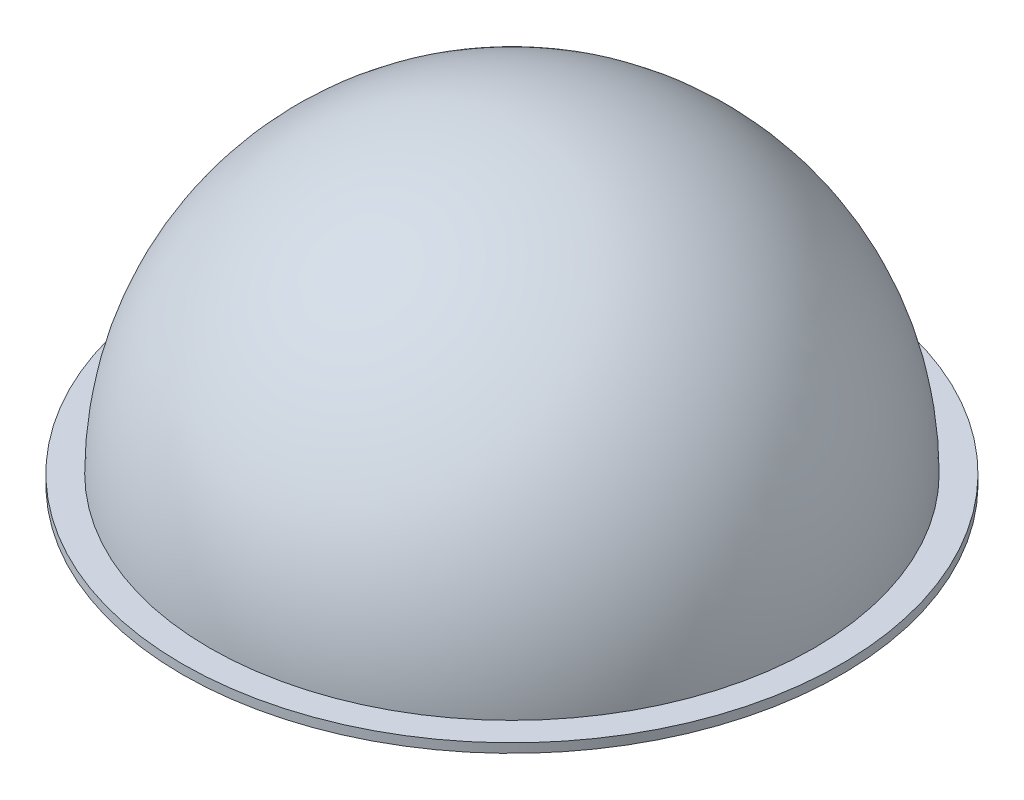
ISO-10303-21;
HEADER;
FILE_DESCRIPTION(('STEP AP214'),'2;1');
FILE_NAME('part.step','',(''),(''),'','','');
FILE_SCHEMA(('AUTOMOTIVE_DESIGN { 1 0 10303 214 1 1 1 1 }'));
ENDSEC;
DATA;
#1=APPLICATION_CONTEXT('core data for automotive mechanical design processes');
#2=APPLICATION_PROTOCOL_DEFINITION('international standard','automotive_design',2000,#1);
#3=PRODUCT_CONTEXT('',#1,'mechanical');
#4=PRODUCT('Part','Part','',(#3));
#5=PRODUCT_RELATED_PRODUCT_CATEGORY('part','',(#4));
#6=PRODUCT_DEFINITION_FORMATION('','',#4);
#7=PRODUCT_DEFINITION_CONTEXT('part definition',#1,'design');
#8=PRODUCT_DEFINITION('design','',#6,#7);
#9=PRODUCT_DEFINITION_SHAPE('','',#8);
#10=(LENGTH_UNIT() NAMED_UNIT(*) SI_UNIT(.MILLI.,.METRE.));
#11=(NAMED_UNIT(*) PLANE_ANGLE_UNIT() SI_UNIT($,.RADIAN.));
#12=(NAMED_UNIT(*) SI_UNIT($,.STERADIAN.) SOLID_ANGLE_UNIT());
#13=UNCERTAINTY_MEASURE_WITH_UNIT(LENGTH_MEASURE(1.E-05),#10,'distance_accuracy_value','');
#14=(GEOMETRIC_REPRESENTATION_CONTEXT(3) GLOBAL_UNCERTAINTY_ASSIGNED_CONTEXT((#13)) GLOBAL_UNIT_ASSIGNED_CONTEXT((#10,
#11,#12)) REPRESENTATION_CONTEXT('',''));
#15=CARTESIAN_POINT('',(0.,0.,0.));
#16=DIRECTION('',(0.,0.,1.));
#17=DIRECTION('',(1.,0.,0.));
#18=AXIS2_PLACEMENT_3D('',#15,#16,#17);
#19=CARTESIAN_POINT('',(0.,0.,0.));
#20=DIRECTION('',(0.,1.,0.));
#21=DIRECTION('',(1.,0.,0.));
#22=AXIS2_PLACEMENT_3D('',#19,#20,#21);
#23=SPHERICAL_SURFACE('',#22,49.5);
#24=CARTESIAN_POINT('',(0.,0.,0.));
#25=DIRECTION('',(0.,1.,0.));
#26=DIRECTION('',(0.,0.,1.));
#27=AXIS2_PLACEMENT_3D('',#24,#25,#26);
#28=CIRCLE('',#27,49.5);
#29=CARTESIAN_POINT('',(0.,0.,49.5));
#30=VERTEX_POINT('',#29);
#31=EDGE_CURVE('E57',#30,#30,#28,.T.);
#32=ORIENTED_EDGE('',*,*,#31,.T.);
#33=EDGE_LOOP('',(#32));
#34=FACE_BOUND('',#33,.T.);
#35=ADVANCED_FACE('F38',(#34),#23,.T.);
#36=CARTESIAN_POINT('',(0.,0.,0.));
#37=DIRECTION('',(0.,1.,0.));
#38=DIRECTION('',(1.,0.,0.));
#39=AXIS2_PLACEMENT_3D('',#36,#37,#38);
#40=SPHERICAL_SURFACE('',#39,48.);
#41=CARTESIAN_POINT('',(0.,0.,0.));
#42=DIRECTION('',(0.,1.,0.));
#43=DIRECTION('',(0.,0.,1.));
#44=AXIS2_PLACEMENT_3D('',#41,#42,#43);
#45=CIRCLE('',#44,48.);
#46=CARTESIAN_POINT('',(0.,0.,48.));
#47=VERTEX_POINT('',#46);
#48=EDGE_CURVE('E10',#47,#47,#45,.T.);
#49=ORIENTED_EDGE('',*,*,#48,.F.);
#50=EDGE_LOOP('',(#49));
#51=FACE_BOUND('',#50,.T.);
#52=ADVANCED_FACE('F81',(#51),#40,.F.);
#53=CARTESIAN_POINT('',(0.,49.5,0.));
#54=DIRECTION('',(0.,1.,0.));
#55=DIRECTION('',(0.,0.,1.));
#56=AXIS2_PLACEMENT_3D('',#53,#54,#55);
#57=CYLINDRICAL_SURFACE('',#56,48.);
#58=CARTESIAN_POINT('',(0.,-1.5,0.));
#59=DIRECTION('',(0.,1.,0.));
#60=DIRECTION('',(0.,0.,1.));
#61=AXIS2_PLACEMENT_3D('',#58,#59,#60);
#62=CIRCLE('',#61,48.);
#63=CARTESIAN_POINT('',(0.,-1.5,48.));
#64=VERTEX_POINT('',#63);
#65=EDGE_CURVE('E44',#64,#64,#62,.T.);
#66=ORIENTED_EDGE('',*,*,#65,.F.);
#67=EDGE_LOOP('',(#66));
#68=FACE_BOUND('',#67,.T.);
#69=ORIENTED_EDGE('',*,*,#48,.T.);
#70=EDGE_LOOP('',(#69));
#71=FACE_BOUND('',#70,.T.);
#72=ADVANCED_FACE('F76',(#68,#71),#57,.F.);
#73=CARTESIAN_POINT('',(48.,-1.5,0.));
#74=DIRECTION('',(0.,1.,0.));
#75=DIRECTION('',(0.,0.,1.));
#76=AXIS2_PLACEMENT_3D('',#73,#74,#75);
#77=PLANE('',#76);
#78=CARTESIAN_POINT('',(0.,-1.5,0.));
#79=DIRECTION('',(0.,1.,0.));
#80=DIRECTION('',(0.,0.,1.));
#81=AXIS2_PLACEMENT_3D('',#78,#79,#80);
#82=CIRCLE('',#81,54.);
#83=CARTESIAN_POINT('',(0.,-1.5,54.));
#84=VERTEX_POINT('',#83);
#85=EDGE_CURVE('E48',#84,#84,#82,.T.);
#86=ORIENTED_EDGE('',*,*,#85,.F.);
#87=EDGE_LOOP('',(#86));
#88=FACE_BOUND('',#87,.T.);
#89=ORIENTED_EDGE('',*,*,#65,.T.);
#90=EDGE_LOOP('',(#89));
#91=FACE_BOUND('',#90,.T.);
#92=ADVANCED_FACE('F71',(#88,#91),#77,.F.);
#93=CARTESIAN_POINT('',(0.,49.5,0.));
#94=DIRECTION('',(0.,1.,0.));
#95=DIRECTION('',(0.,0.,1.));
#96=AXIS2_PLACEMENT_3D('',#93,#94,#95);
#97=CYLINDRICAL_SURFACE('',#96,54.);
#98=CARTESIAN_POINT('',(0.,0.,0.));
#99=DIRECTION('',(0.,1.,0.));
#100=DIRECTION('',(0.,0.,1.));
#101=AXIS2_PLACEMENT_3D('',#98,#99,#100);
#102=CIRCLE('',#101,54.);
#103=CARTESIAN_POINT('',(0.,0.,54.));
#104=VERTEX_POINT('',#103);
#105=EDGE_CURVE('E52',#104,#104,#102,.T.);
#106=ORIENTED_EDGE('',*,*,#105,.F.);
#107=EDGE_LOOP('',(#106));
#108=FACE_BOUND('',#107,.T.);
#109=ORIENTED_EDGE('',*,*,#85,.T.);
#110=EDGE_LOOP('',(#109));
#111=FACE_BOUND('',#110,.T.);
#112=ADVANCED_FACE('F65',(#108,#111),#97,.T.);
#113=CARTESIAN_POINT('',(54.,0.,0.));
#114=DIRECTION('',(0.,-1.,0.));
#115=DIRECTION('',(0.,0.,-1.));
#116=AXIS2_PLACEMENT_3D('',#113,#114,#115);
#117=PLANE('',#116);
#118=ORIENTED_EDGE('',*,*,#31,.F.);
#119=EDGE_LOOP('',(#118));
#120=FACE_BOUND('',#119,.T.);
#121=ORIENTED_EDGE('',*,*,#105,.T.);
#122=EDGE_LOOP('',(#121));
#123=FACE_BOUND('',#122,.T.);
#124=ADVANCED_FACE('F62',(#120,#123),#117,.F.);
#125=CLOSED_SHELL('',(#35,#52,#72,#92,#112,#124));
#126=MANIFOLD_SOLID_BREP('B2',#125);
#127=ADVANCED_BREP_SHAPE_REPRESENTATION('',(#18,#126),#14);
#128=SHAPE_DEFINITION_REPRESENTATION(#9,#127);
ENDSEC;
END-ISO-10303-21;
